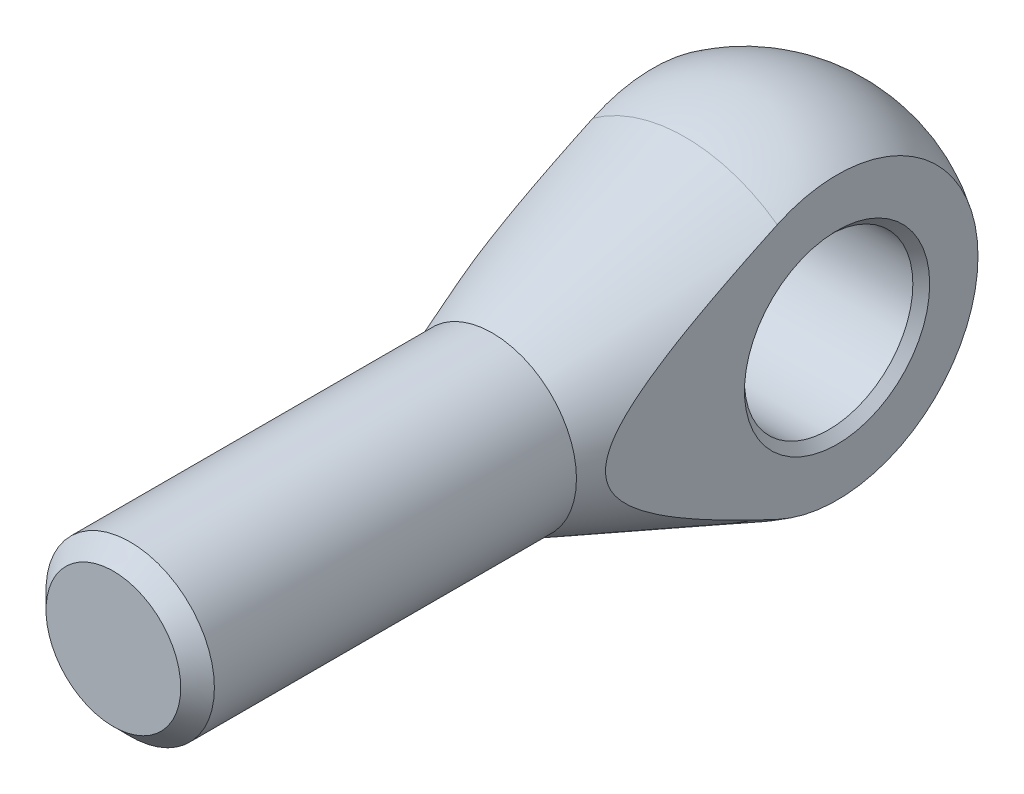
ISO-10303-21;
HEADER;
FILE_DESCRIPTION(('STEP AP214'),'2;1');
FILE_NAME('part.step','',(''),(''),'','','');
FILE_SCHEMA(('AUTOMOTIVE_DESIGN { 1 0 10303 214 1 1 1 1 }'));
ENDSEC;
DATA;
#1=APPLICATION_CONTEXT('core data for automotive mechanical design processes');
#2=APPLICATION_PROTOCOL_DEFINITION('international standard','automotive_design',2000,#1);
#3=PRODUCT_CONTEXT('',#1,'mechanical');
#4=PRODUCT('Part','Part','',(#3));
#5=PRODUCT_RELATED_PRODUCT_CATEGORY('part','',(#4));
#6=PRODUCT_DEFINITION_FORMATION('','',#4);
#7=PRODUCT_DEFINITION_CONTEXT('part definition',#1,'design');
#8=PRODUCT_DEFINITION('design','',#6,#7);
#9=PRODUCT_DEFINITION_SHAPE('','',#8);
#10=(LENGTH_UNIT() NAMED_UNIT(*) SI_UNIT(.MILLI.,.METRE.));
#11=(NAMED_UNIT(*) PLANE_ANGLE_UNIT() SI_UNIT($,.RADIAN.));
#12=(NAMED_UNIT(*) SI_UNIT($,.STERADIAN.) SOLID_ANGLE_UNIT());
#13=UNCERTAINTY_MEASURE_WITH_UNIT(LENGTH_MEASURE(1.E-05),#10,'distance_accuracy_value','');
#14=(GEOMETRIC_REPRESENTATION_CONTEXT(3) GLOBAL_UNCERTAINTY_ASSIGNED_CONTEXT((#13)) GLOBAL_UNIT_ASSIGNED_CONTEXT((#10,
#11,#12)) REPRESENTATION_CONTEXT('',''));
#15=CARTESIAN_POINT('',(0.,0.,0.));
#16=DIRECTION('',(0.,0.,1.));
#17=DIRECTION('',(1.,0.,0.));
#18=AXIS2_PLACEMENT_3D('',#15,#16,#17);
#19=CARTESIAN_POINT('',(0.,0.,0.));
#20=DIRECTION('',(1.,0.,0.));
#21=DIRECTION('',(0.,-1.,0.));
#22=AXIS2_PLACEMENT_3D('',#19,#20,#21);
#23=SPHERICAL_SURFACE('',#22,20.);
#24=CARTESIAN_POINT('',(0.,0.,7.10102051443365));
#25=DIRECTION('',(0.,0.,-1.));
#26=DIRECTION('',(0.,1.,0.));
#27=AXIS2_PLACEMENT_3D('',#24,#25,#26);
#28=CIRCLE('',#27,18.6969384566991);
#29=CARTESIAN_POINT('',(-10.95,-15.1549664352513,7.10102051443364));
#30=VERTEX_POINT('',#29);
#31=CARTESIAN_POINT('',(10.95,-15.1549664352513,7.10102051443365));
#32=VERTEX_POINT('',#31);
#33=EDGE_CURVE('E77',#30,#32,#28,.F.);
#34=ORIENTED_EDGE('',*,*,#33,.F.);
#35=CARTESIAN_POINT('',(-10.95,0.,0.));
#36=DIRECTION('',(-1.,0.,0.));
#37=DIRECTION('',(0.,0.,1.));
#38=AXIS2_PLACEMENT_3D('',#35,#36,#37);
#39=CIRCLE('',#38,16.7361136468417);
#40=CARTESIAN_POINT('',(-10.95,15.1549664352513,7.10102051443365));
#41=VERTEX_POINT('',#40);
#42=EDGE_CURVE('E65',#30,#41,#39,.F.);
#43=ORIENTED_EDGE('',*,*,#42,.T.);
#44=CARTESIAN_POINT('',(10.95,15.1549664352513,7.10102051443365));
#45=VERTEX_POINT('',#44);
#46=EDGE_CURVE('E81',#45,#41,#28,.F.);
#47=ORIENTED_EDGE('',*,*,#46,.F.);
#48=CARTESIAN_POINT('',(10.95,0.,0.));
#49=DIRECTION('',(1.,0.,0.));
#50=DIRECTION('',(0.,0.,-1.));
#51=AXIS2_PLACEMENT_3D('',#48,#49,#50);
#52=CIRCLE('',#51,16.7361136468417);
#53=EDGE_CURVE('E58',#45,#32,#52,.F.);
#54=ORIENTED_EDGE('',*,*,#53,.T.);
#55=EDGE_LOOP('',(#34,#43,#47,#54));
#56=FACE_BOUND('',#55,.T.);
#57=ADVANCED_FACE('F43',(#56),#23,.T.);
#58=CARTESIAN_POINT('',(0.,0.,7.10102051443364));
#59=DIRECTION('',(0.,0.,-1.));
#60=DIRECTION('',(0.,1.,0.));
#61=AXIS2_PLACEMENT_3D('',#58,#59,#60);
#62=CONICAL_SURFACE('',#61,18.6969384566991,0.362968648605641);
#63=CARTESIAN_POINT('',(0.,0.,30.));
#64=DIRECTION('',(0.,0.,1.));
#65=DIRECTION('',(1.,0.,0.));
#66=AXIS2_PLACEMENT_3D('',#63,#64,#65);
#67=CIRCLE('',#66,10.);
#68=CARTESIAN_POINT('',(10.,0.,30.));
#69=VERTEX_POINT('',#68);
#70=EDGE_CURVE('E85',#69,#69,#67,.T.);
#71=ORIENTED_EDGE('',*,*,#70,.F.);
#72=EDGE_LOOP('',(#71));
#73=FACE_BOUND('',#72,.T.);
#74=ORIENTED_EDGE('',*,*,#46,.T.);
#75=CARTESIAN_POINT('',(-10.95,33.6117111502292,-36.7473868844414));
#76=CARTESIAN_POINT('',(-10.95,33.2100087233072,-35.7417349593616));
#77=CARTESIAN_POINT('',(-10.95,32.8077157218095,-34.7363189988211));
#78=CARTESIAN_POINT('',(-10.95,32.0018003338569,-32.7260191972657));
#79=CARTESIAN_POINT('',(-10.95,31.5981779464226,-31.7211353566434));
#80=CARTESIAN_POINT('',(-10.95,30.3850704903985,-28.7073130348301));
#81=CARTESIAN_POINT('',(-10.95,29.5733696972676,-26.6992653148223));
#82=CARTESIAN_POINT('',(-10.95,27.9413836796302,-22.6835120174359));
#83=CARTESIAN_POINT('',(-10.95,27.1210883762279,-20.6758105339449));
#84=CARTESIAN_POINT('',(-10.95,25.4707916822328,-16.664443390457));
#85=CARTESIAN_POINT('',(-10.95,24.6407905016179,-14.6607776442458));
#86=CARTESIAN_POINT('',(-10.95,23.3832101454071,-11.6526201035789));
#87=CARTESIAN_POINT('',(-10.95,22.9604894420974,-10.646097020541));
#88=CARTESIAN_POINT('',(-10.95,22.1111648794169,-8.63469121112854));
#89=CARTESIAN_POINT('',(-10.95,21.6845610261705,-7.62980848216987));
#90=CARTESIAN_POINT('',(-10.95,20.8267363544043,-5.62193345648901));
#91=CARTESIAN_POINT('',(-10.95,20.3955152239481,-4.61894129294296));
#92=CARTESIAN_POINT('',(-10.95,19.5275832192706,-2.61533602472807));
#93=CARTESIAN_POINT('',(-10.95,19.0908723602655,-1.61472291347415));
#94=CARTESIAN_POINT('',(-10.95,18.2110855033613,0.382913644239497));
#95=CARTESIAN_POINT('',(-10.95,17.7680139102391,1.37993902843665));
#96=CARTESIAN_POINT('',(-10.95,16.8736823235612,3.37033269066247));
#97=CARTESIAN_POINT('',(-10.95,16.4224222249312,4.36370092156581));
#98=CARTESIAN_POINT('',(-10.95,15.5096901384702,6.34559948082246));
#99=CARTESIAN_POINT('',(-10.95,15.0482193642475,7.33413036725253));
#100=CARTESIAN_POINT('',(-10.95,14.1121476710677,9.30494471143386));
#101=CARTESIAN_POINT('',(-10.95,13.6375472089903,10.287228385113));
#102=CARTESIAN_POINT('',(-10.95,12.9408840332531,11.6969691534924));
#103=CARTESIAN_POINT('',(-10.95,12.7258235280496,12.1278888460484));
#104=CARTESIAN_POINT('',(-10.95,12.2917992901895,12.9877648924916));
#105=CARTESIAN_POINT('',(-10.95,12.0728355286525,13.4167212318223));
#106=CARTESIAN_POINT('',(-10.95,11.6303521918964,14.2724462389769));
#107=CARTESIAN_POINT('',(-10.95,11.4068312483256,14.6992142001016));
#108=CARTESIAN_POINT('',(-10.95,10.954567840359,15.5499748875007));
#109=CARTESIAN_POINT('',(-10.95,10.7258254132507,15.9739676335654));
#110=CARTESIAN_POINT('',(-10.95,10.2613939787212,16.8200740591547));
#111=CARTESIAN_POINT('',(-10.95,10.0256834257222,17.242175936597));
#112=CARTESIAN_POINT('',(-10.95,9.54692360155703,18.0821937590202));
#113=CARTESIAN_POINT('',(-10.95,9.30387450636588,18.500109804056));
#114=CARTESIAN_POINT('',(-10.95,8.80904725841946,19.3304799028364));
#115=CARTESIAN_POINT('',(-10.95,8.55727351103914,19.7429365718982));
#116=CARTESIAN_POINT('',(-10.95,8.04292231859658,20.5610241312773));
#117=CARTESIAN_POINT('',(-10.95,7.78034590233842,20.9666556664335));
#118=CARTESIAN_POINT('',(-10.95,7.23960258445815,21.7720503819625));
#119=CARTESIAN_POINT('',(-10.95,6.9613306220719,22.1717437135398));
#120=CARTESIAN_POINT('',(-10.95,6.53067505376456,22.7618733866236));
#121=CARTESIAN_POINT('',(-10.95,6.38484825046696,22.9570986234064));
#122=CARTESIAN_POINT('',(-10.95,6.0881771981951,23.3436910460863));
#123=CARTESIAN_POINT('',(-10.95,5.93733329791744,23.5350584986272));
#124=CARTESIAN_POINT('',(-10.95,5.63077086236499,23.9120415169794));
#125=CARTESIAN_POINT('',(-10.95,5.47508526660816,24.0976837876929));
#126=CARTESIAN_POINT('',(-10.95,5.15717583081845,24.4632614250757));
#127=CARTESIAN_POINT('',(-10.95,4.99495295364302,24.6431976252502));
#128=CARTESIAN_POINT('',(-10.95,4.66313643223939,24.995728664026));
#129=CARTESIAN_POINT('',(-10.95,4.49355270824336,25.1683327988046));
#130=CARTESIAN_POINT('',(-10.95,4.14566626307245,25.5044679715233));
#131=CARTESIAN_POINT('',(-10.95,3.96736698861797,25.6680025424362));
#132=CARTESIAN_POINT('',(-10.95,3.66128628131259,25.9312199338345));
#133=CARTESIAN_POINT('',(-10.95,3.53629016963108,26.0341390287964));
#134=CARTESIAN_POINT('',(-10.95,3.28133090419108,26.2336790845882));
#135=CARTESIAN_POINT('',(-10.95,3.15136739943034,26.3302995990424));
#136=CARTESIAN_POINT('',(-10.95,2.88602358056451,26.5159738348143));
#137=CARTESIAN_POINT('',(-10.95,2.75064135477668,26.6050248504388));
#138=CARTESIAN_POINT('',(-10.95,2.47429160016425,26.773892011185));
#139=CARTESIAN_POINT('',(-10.95,2.3333248298523,26.8537094047162));
#140=CARTESIAN_POINT('',(-10.95,1.94398775658874,27.0546611626469));
#141=CARTESIAN_POINT('',(-10.95,1.68989652496238,27.1653037907263));
#142=CARTESIAN_POINT('',(-10.95,1.29803225675867,27.298798828343));
#143=CARTESIAN_POINT('',(-10.95,1.16568400184323,27.3378755468031));
#144=CARTESIAN_POINT('',(-10.95,0.898038721377125,27.4039807051444));
#145=CARTESIAN_POINT('',(-10.95,0.762743441456939,27.4310160843652));
#146=CARTESIAN_POINT('',(-10.95,0.488705913790869,27.472227697509));
#147=CARTESIAN_POINT('',(-10.95,0.349942255463335,27.4862628016695));
#148=CARTESIAN_POINT('',(-10.95,0.0717033778222913,27.500363811325));
#149=CARTESIAN_POINT('',(-10.95,-0.067771812589703,27.5004302797607));
#150=CARTESIAN_POINT('',(-10.95,-0.346120162657845,27.4865857143661));
#151=CARTESIAN_POINT('',(-10.95,-0.484992816520058,27.4726646162149));
#152=CARTESIAN_POINT('',(-10.95,-0.760727242900616,27.4314376993854));
#153=CARTESIAN_POINT('',(-10.95,-0.897588769927313,27.4041302604318));
#154=CARTESIAN_POINT('',(-10.95,-1.18085762309287,27.3340854850686));
#155=CARTESIAN_POINT('',(-10.95,-1.32696674399089,27.2901478893058));
#156=CARTESIAN_POINT('',(-10.95,-1.61468037543159,27.189306774172));
#157=CARTESIAN_POINT('',(-10.95,-1.75628164999085,27.1323941695975));
#158=CARTESIAN_POINT('',(-10.95,-2.17377369890063,26.9449108319188));
#159=CARTESIAN_POINT('',(-10.95,-2.44220606848874,26.7976341442337));
#160=CARTESIAN_POINT('',(-10.95,-2.93407515179228,26.4875701703933));
#161=CARTESIAN_POINT('',(-10.95,-3.15936141832807,26.3276028915265));
#162=CARTESIAN_POINT('',(-10.95,-3.5956500495048,25.9890096488688));
#163=CARTESIAN_POINT('',(-10.95,-3.80663902512319,25.8103665830865));
#164=CARTESIAN_POINT('',(-10.95,-4.21688715470744,25.4388061611562));
#165=CARTESIAN_POINT('',(-10.95,-4.4161015100315,25.2458398927565));
#166=CARTESIAN_POINT('',(-10.95,-4.70690853217967,24.9487233221588));
#167=CARTESIAN_POINT('',(-10.95,-4.80249054619742,24.8484269661759));
#168=CARTESIAN_POINT('',(-10.95,-4.99121797099734,24.6455666765238));
#169=CARTESIAN_POINT('',(-10.95,-5.08436339516438,24.5430027553168));
#170=CARTESIAN_POINT('',(-10.95,-5.3538739763897,24.2397302010473));
#171=CARTESIAN_POINT('',(-10.95,-5.52720294589203,24.036319825678));
#172=CARTESIAN_POINT('',(-10.95,-5.8667773286528,23.6236508754011));
#173=CARTESIAN_POINT('',(-10.95,-6.03302156085291,23.4143913349642));
#174=CARTESIAN_POINT('',(-10.95,-6.35949535205869,22.9910513173421));
#175=CARTESIAN_POINT('',(-10.95,-6.51972139630262,22.7769681363007));
#176=CARTESIAN_POINT('',(-10.95,-6.83488007897038,22.3449329120949));
#177=CARTESIAN_POINT('',(-10.95,-6.9898123755094,22.1269806204286));
#178=CARTESIAN_POINT('',(-10.95,-7.4483760399936,21.4673808373101));
#179=CARTESIAN_POINT('',(-10.95,-7.74507506060751,21.0209112441707));
#180=CARTESIAN_POINT('',(-10.95,-8.32420109044812,20.1188100878175));
#181=CARTESIAN_POINT('',(-10.95,-8.6066262643993,19.6631773569182));
#182=CARTESIAN_POINT('',(-10.95,-9.02300492631213,18.9724610232141));
#183=CARTESIAN_POINT('',(-10.95,-9.16120701213975,18.7399237596161));
#184=CARTESIAN_POINT('',(-10.95,-9.43498757849718,18.2733332431444));
#185=CARTESIAN_POINT('',(-10.95,-9.57056625472792,18.0392801051039));
#186=CARTESIAN_POINT('',(-10.95,-9.97380851664279,17.3350620874898));
#187=CARTESIAN_POINT('',(-10.95,-10.2379531332269,16.8628806460893));
#188=CARTESIAN_POINT('',(-10.95,-10.7581044356187,15.9150581516268));
#189=CARTESIAN_POINT('',(-10.95,-11.0141234957464,15.4394238630781));
#190=CARTESIAN_POINT('',(-10.95,-11.5197188561085,14.4847699564357));
#191=CARTESIAN_POINT('',(-10.95,-11.7692953836263,14.0057504585288));
#192=CARTESIAN_POINT('',(-10.95,-12.2870580221873,12.9981112885397));
#193=CARTESIAN_POINT('',(-10.95,-12.5546880734431,12.4692063019444));
#194=CARTESIAN_POINT('',(-10.95,-13.0844262053536,11.4086347917532));
#195=CARTESIAN_POINT('',(-10.95,-13.3465342202796,10.8769682353802));
#196=CARTESIAN_POINT('',(-10.95,-13.8660531072914,9.81131283657434));
#197=CARTESIAN_POINT('',(-10.95,-14.1234637304854,9.2773238729342));
#198=CARTESIAN_POINT('',(-10.95,-14.6342247858855,8.20740630777338));
#199=CARTESIAN_POINT('',(-10.95,-14.8875751947647,7.67147769513063));
#200=CARTESIAN_POINT('',(-10.95,-15.642461174617,6.06100943113125));
#201=CARTESIAN_POINT('',(-10.95,-16.1387285643732,4.98399968103441));
#202=CARTESIAN_POINT('',(-10.95,-17.1204631578094,2.82506938339125));
#203=CARTESIAN_POINT('',(-10.95,-17.605930232712,1.7431487774754));
#204=CARTESIAN_POINT('',(-10.95,-18.3280816448888,0.116570996183408));
#205=CARTESIAN_POINT('',(-10.95,-18.5679759046434,-0.426664227899682));
#206=CARTESIAN_POINT('',(-10.95,-19.0458304945214,-1.51397986348042));
#207=CARTESIAN_POINT('',(-10.95,-19.2837908388247,-2.05806026874614));
#208=CARTESIAN_POINT('',(-10.95,-19.9950782157829,-3.69144165744211));
#209=CARTESIAN_POINT('',(-10.95,-20.4658077364439,-4.78187411052378));
#210=CARTESIAN_POINT('',(-10.95,-21.4015389530705,-6.96502236343922));
#211=CARTESIAN_POINT('',(-10.95,-21.8665413870241,-8.05773784740234));
#212=CARTESIAN_POINT('',(-10.95,-22.791830118973,-10.2451640600059));
#213=CARTESIAN_POINT('',(-10.95,-23.2521164108862,-11.3398747912174));
#214=CARTESIAN_POINT('',(-10.95,-24.5557492331203,-14.4560329541505));
#215=CARTESIAN_POINT('',(-10.95,-25.3943569244173,-16.4794626912536));
#216=CARTESIAN_POINT('',(-10.95,-27.0616145709659,-20.5305051617139));
#217=CARTESIAN_POINT('',(-10.95,-27.8902641341802,-22.558118056098));
#218=CARTESIAN_POINT('',(-10.95,-29.5377964173734,-26.6113591628902));
#219=CARTESIAN_POINT('',(-10.95,-30.3566984745872,-28.6369795196071));
#220=CARTESIAN_POINT('',(-10.95,-31.5805135935852,-31.6771769022293));
#221=CARTESIAN_POINT('',(-10.95,-31.9876857319123,-32.6908456810704));
#222=CARTESIAN_POINT('',(-10.95,-32.8006759147025,-34.7187252449435));
#223=CARTESIAN_POINT('',(-10.95,-33.2064939601989,-35.7329360295612));
#224=CARTESIAN_POINT('',(-10.95,-33.6117111502292,-36.7473868844414));
#225=B_SPLINE_CURVE_WITH_KNOTS('',3,(#75,#76,#77,#78,#79,#80,#81,#82,#83,#84,#85,#86,#87,#88,
#89,#90,#91,#92,#93,#94,#95,#96,#97,#98,#99,#100,#101,#102,#103,#104,#105,#106,#107,#108,#109,
#110,#111,#112,#113,#114,#115,#116,#117,#118,#119,#120,#121,#122,#123,#124,#125,#126,#127,#128,
#129,#130,#131,#132,#133,#134,#135,#136,#137,#138,#139,#140,#141,#142,#143,#144,#145,#146,#147,
#148,#149,#150,#151,#152,#153,#154,#155,#156,#157,#158,#159,#160,#161,#162,#163,#164,#165,#166,
#167,#168,#169,#170,#171,#172,#173,#174,#175,#176,#177,#178,#179,#180,#181,#182,#183,#184,#185,
#186,#187,#188,#189,#190,#191,#192,#193,#194,#195,#196,#197,#198,#199,#200,#201,#202,#203,#204,
#205,#206,#207,#208,#209,#210,#211,#212,#213,#214,#215,#216,#217,#218,#219,#220,#221,#222,#223,
#224),.UNSPECIFIED.,.F.,.F.,(4,2,2,2,2,2,2,2,2,2,2,2,2,2,2,2,2,2,2,2,2,2,2,2,2,2,2,2,2,2,2,2,2,
2,2,2,2,2,2,2,2,2,2,2,2,2,2,2,2,2,2,2,2,2,2,2,2,2,2,2,2,2,2,2,2,2,2,2,2,2,2,2,2,2,4),(0.,
3.24873867555938,6.4974797451895,12.9951607323639,19.5015823416852,26.007863449845,
29.2829194521491,32.5579702901449,35.8332437995588,39.1085082326272,42.3816045967868,
45.6547429908025,48.9274944178938,52.2001321044556,53.64492976606,55.0897381222216,
56.5349868828041,57.9802253258489,59.4305314720913,60.8808028681897,62.3303523480678,
63.7797640966289,65.2404094780302,65.9713749950522,66.7022898144808,67.429010381264,
68.1556242998897,68.881287646476,69.6066663022981,70.092244917844,70.5778579086499,
71.0636437566711,71.5493638482422,72.3771682641807,72.7907038270207,73.2040007628756,
73.6217335579651,74.039449518283,74.4574662485828,74.8755335878936,75.3325402189688,
75.7898678379036,76.7049729710382,77.5327790155381,78.3613498600875,79.1928933555429,
79.6085025887215,80.0241095383608,80.825625591773,81.6272747430609,82.4293850183088,
83.2315469985102,84.8393362776209,86.4473317568204,87.258834487682,88.0702764468997,
89.6933073866293,91.3137348345806,92.9341050377958,94.7123511557926,96.4906184282429,
98.2689796503822,100.047351085964,103.6048017838,107.162294876148,108.94383140567,
110.725354860831,114.288430328239,117.851041752989,121.4136577717,127.984596899439,
134.55579387387,141.110446653136,144.387612680272,147.664776205967),.UNSPECIFIED.);
#226=EDGE_CURVE('E76',#41,#30,#225,.T.);
#227=ORIENTED_EDGE('',*,*,#226,.T.);
#228=ORIENTED_EDGE('',*,*,#33,.T.);
#229=CARTESIAN_POINT('',(10.95,-33.6117111502292,-36.7473868844414));
#230=CARTESIAN_POINT('',(10.95,-33.2100087233071,-35.7417349593616));
#231=CARTESIAN_POINT('',(10.95,-32.8077157218094,-34.7363189988211));
#232=CARTESIAN_POINT('',(10.95,-32.0018003338569,-32.7260191972657));
#233=CARTESIAN_POINT('',(10.95,-31.5981779464226,-31.7211353566434));
#234=CARTESIAN_POINT('',(10.95,-30.3850704903985,-28.7073130348301));
#235=CARTESIAN_POINT('',(10.95,-29.5733696972676,-26.6992653148223));
#236=CARTESIAN_POINT('',(10.95,-27.9413836796302,-22.6835120174359));
#237=CARTESIAN_POINT('',(10.95,-27.1210883762279,-20.6758105339449));
#238=CARTESIAN_POINT('',(10.95,-25.4707916822328,-16.664443390457));
#239=CARTESIAN_POINT('',(10.95,-24.6407905016178,-14.6607776442458));
#240=CARTESIAN_POINT('',(10.95,-23.3832101454071,-11.6526201035789));
#241=CARTESIAN_POINT('',(10.95,-22.9604894420974,-10.646097020541));
#242=CARTESIAN_POINT('',(10.95,-22.1111648794169,-8.63469121112854));
#243=CARTESIAN_POINT('',(10.95,-21.6845610261705,-7.62980848216987));
#244=CARTESIAN_POINT('',(10.95,-20.8267363544043,-5.62193345648901));
#245=CARTESIAN_POINT('',(10.95,-20.3955152239481,-4.61894129294297));
#246=CARTESIAN_POINT('',(10.95,-19.5275832192706,-2.61533602472807));
#247=CARTESIAN_POINT('',(10.95,-19.0908723602655,-1.61472291347415));
#248=CARTESIAN_POINT('',(10.95,-18.2110855033613,0.382913644239501));
#249=CARTESIAN_POINT('',(10.95,-17.7680139102391,1.37993902843666));
#250=CARTESIAN_POINT('',(10.95,-16.8736823235612,3.37033269066248));
#251=CARTESIAN_POINT('',(10.95,-16.4224222249312,4.36370092156582));
#252=CARTESIAN_POINT('',(10.95,-15.5096901384702,6.34559948082246));
#253=CARTESIAN_POINT('',(10.95,-15.0482193642475,7.33413036725254));
#254=CARTESIAN_POINT('',(10.95,-14.1121476710677,9.30494471143387));
#255=CARTESIAN_POINT('',(10.95,-13.6375472089903,10.287228385113));
#256=CARTESIAN_POINT('',(10.95,-12.9408840332531,11.6969691534924));
#257=CARTESIAN_POINT('',(10.95,-12.7258235280496,12.1278888460484));
#258=CARTESIAN_POINT('',(10.95,-12.2917992901895,12.9877648924916));
#259=CARTESIAN_POINT('',(10.95,-12.0728355286525,13.4167212318223));
#260=CARTESIAN_POINT('',(10.95,-11.6303521918964,14.2724462389769));
#261=CARTESIAN_POINT('',(10.95,-11.4068312483256,14.6992142001016));
#262=CARTESIAN_POINT('',(10.95,-10.954567840359,15.5499748875007));
#263=CARTESIAN_POINT('',(10.95,-10.7258254132507,15.9739676335654));
#264=CARTESIAN_POINT('',(10.95,-10.2613939787212,16.8200740591547));
#265=CARTESIAN_POINT('',(10.95,-10.0256834257222,17.242175936597));
#266=CARTESIAN_POINT('',(10.95,-9.54692360155703,18.0821937590202));
#267=CARTESIAN_POINT('',(10.95,-9.30387450636588,18.500109804056));
#268=CARTESIAN_POINT('',(10.95,-8.80904725841946,19.3304799028364));
#269=CARTESIAN_POINT('',(10.95,-8.55727351103915,19.7429365718982));
#270=CARTESIAN_POINT('',(10.95,-8.04292231859659,20.5610241312773));
#271=CARTESIAN_POINT('',(10.95,-7.78034590233842,20.9666556664335));
#272=CARTESIAN_POINT('',(10.95,-7.23960258445815,21.7720503819625));
#273=CARTESIAN_POINT('',(10.95,-6.9613306220719,22.1717437135398));
#274=CARTESIAN_POINT('',(10.95,-6.53067505376456,22.7618733866236));
#275=CARTESIAN_POINT('',(10.95,-6.38484825046695,22.9570986234064));
#276=CARTESIAN_POINT('',(10.95,-6.08817719819509,23.3436910460863));
#277=CARTESIAN_POINT('',(10.95,-5.93733329791743,23.5350584986273));
#278=CARTESIAN_POINT('',(10.95,-5.63077086236499,23.9120415169794));
#279=CARTESIAN_POINT('',(10.95,-5.47508526660817,24.0976837876929));
#280=CARTESIAN_POINT('',(10.95,-5.15717583081845,24.4632614250757));
#281=CARTESIAN_POINT('',(10.95,-4.99495295364303,24.6431976252502));
#282=CARTESIAN_POINT('',(10.95,-4.6631364322394,24.995728664026));
#283=CARTESIAN_POINT('',(10.95,-4.49355270824336,25.1683327988046));
#284=CARTESIAN_POINT('',(10.95,-4.14566626307245,25.5044679715233));
#285=CARTESIAN_POINT('',(10.95,-3.96736698861797,25.6680025424362));
#286=CARTESIAN_POINT('',(10.95,-3.66128628131259,25.9312199338345));
#287=CARTESIAN_POINT('',(10.95,-3.53629016963108,26.0341390287964));
#288=CARTESIAN_POINT('',(10.95,-3.28133090419108,26.2336790845882));
#289=CARTESIAN_POINT('',(10.95,-3.15136739943035,26.3302995990424));
#290=CARTESIAN_POINT('',(10.95,-2.88602358056451,26.5159738348143));
#291=CARTESIAN_POINT('',(10.95,-2.75064135477669,26.6050248504388));
#292=CARTESIAN_POINT('',(10.95,-2.47429160016425,26.773892011185));
#293=CARTESIAN_POINT('',(10.95,-2.33332482985231,26.8537094047162));
#294=CARTESIAN_POINT('',(10.95,-1.94398775658875,27.0546611626469));
#295=CARTESIAN_POINT('',(10.95,-1.6898965249624,27.1653037907263));
#296=CARTESIAN_POINT('',(10.95,-1.29803225675869,27.298798828343));
#297=CARTESIAN_POINT('',(10.95,-1.16568400184324,27.3378755468031));
#298=CARTESIAN_POINT('',(10.95,-0.898038721377133,27.4039807051444));
#299=CARTESIAN_POINT('',(10.95,-0.762743441456947,27.4310160843652));
#300=CARTESIAN_POINT('',(10.95,-0.488705913790873,27.472227697509));
#301=CARTESIAN_POINT('',(10.95,-0.349942255463334,27.4862628016695));
#302=CARTESIAN_POINT('',(10.95,-0.0717033778222897,27.500363811325));
#303=CARTESIAN_POINT('',(10.95,0.0677718125897002,27.5004302797607));
#304=CARTESIAN_POINT('',(10.95,0.346120162657838,27.4865857143661));
#305=CARTESIAN_POINT('',(10.95,0.484992816520051,27.4726646162149));
#306=CARTESIAN_POINT('',(10.95,0.760727242900609,27.4314376993853));
#307=CARTESIAN_POINT('',(10.95,0.897588769927306,27.4041302604318));
#308=CARTESIAN_POINT('',(10.95,1.18085762309287,27.3340854850686));
#309=CARTESIAN_POINT('',(10.95,1.32696674399089,27.2901478893058));
#310=CARTESIAN_POINT('',(10.95,1.61468037543159,27.189306774172));
#311=CARTESIAN_POINT('',(10.95,1.75628164999086,27.1323941695975));
#312=CARTESIAN_POINT('',(10.95,2.17377369890063,26.9449108319188));
#313=CARTESIAN_POINT('',(10.95,2.44220606848874,26.7976341442337));
#314=CARTESIAN_POINT('',(10.95,2.93407515179227,26.4875701703933));
#315=CARTESIAN_POINT('',(10.95,3.15936141832807,26.3276028915265));
#316=CARTESIAN_POINT('',(10.95,3.59565004950481,25.9890096488688));
#317=CARTESIAN_POINT('',(10.95,3.80663902512319,25.8103665830865));
#318=CARTESIAN_POINT('',(10.95,4.21688715470743,25.4388061611562));
#319=CARTESIAN_POINT('',(10.95,4.4161015100315,25.2458398927565));
#320=CARTESIAN_POINT('',(10.95,4.70690853217968,24.9487233221588));
#321=CARTESIAN_POINT('',(10.95,4.80249054619743,24.8484269661759));
#322=CARTESIAN_POINT('',(10.95,4.99121797099734,24.6455666765238));
#323=CARTESIAN_POINT('',(10.95,5.08436339516437,24.5430027553168));
#324=CARTESIAN_POINT('',(10.95,5.35387397638969,24.2397302010473));
#325=CARTESIAN_POINT('',(10.95,5.52720294589203,24.036319825678));
#326=CARTESIAN_POINT('',(10.95,5.86677732865279,23.6236508754011));
#327=CARTESIAN_POINT('',(10.95,6.03302156085291,23.4143913349642));
#328=CARTESIAN_POINT('',(10.95,6.35949535205868,22.9910513173421));
#329=CARTESIAN_POINT('',(10.95,6.5197213963026,22.7769681363007));
#330=CARTESIAN_POINT('',(10.95,6.83488007897037,22.3449329120949));
#331=CARTESIAN_POINT('',(10.95,6.98981237550939,22.1269806204286));
#332=CARTESIAN_POINT('',(10.95,7.44837603999359,21.4673808373102));
#333=CARTESIAN_POINT('',(10.95,7.7450750606075,21.0209112441708));
#334=CARTESIAN_POINT('',(10.95,8.32420109044811,20.1188100878175));
#335=CARTESIAN_POINT('',(10.95,8.60662626439929,19.6631773569182));
#336=CARTESIAN_POINT('',(10.95,9.02300492631212,18.9724610232141));
#337=CARTESIAN_POINT('',(10.95,9.16120701213975,18.7399237596161));
#338=CARTESIAN_POINT('',(10.95,9.43498757849718,18.2733332431444));
#339=CARTESIAN_POINT('',(10.95,9.57056625472792,18.0392801051039));
#340=CARTESIAN_POINT('',(10.95,9.97380851664278,17.3350620874898));
#341=CARTESIAN_POINT('',(10.95,10.2379531332269,16.8628806460893));
#342=CARTESIAN_POINT('',(10.95,10.7581044356187,15.9150581516268));
#343=CARTESIAN_POINT('',(10.95,11.0141234957464,15.4394238630781));
#344=CARTESIAN_POINT('',(10.95,11.5197188561085,14.4847699564357));
#345=CARTESIAN_POINT('',(10.95,11.7692953836263,14.0057504585288));
#346=CARTESIAN_POINT('',(10.95,12.2870580221873,12.9981112885397));
#347=CARTESIAN_POINT('',(10.95,12.5546880734431,12.4692063019444));
#348=CARTESIAN_POINT('',(10.95,13.0844262053536,11.4086347917532));
#349=CARTESIAN_POINT('',(10.95,13.3465342202796,10.8769682353802));
#350=CARTESIAN_POINT('',(10.95,13.8660531072914,9.81131283657434));
#351=CARTESIAN_POINT('',(10.95,14.1234637304854,9.2773238729342));
#352=CARTESIAN_POINT('',(10.95,14.6342247858855,8.20740630777339));
#353=CARTESIAN_POINT('',(10.95,14.8875751947647,7.67147769513064));
#354=CARTESIAN_POINT('',(10.95,15.642461174617,6.06100943113126));
#355=CARTESIAN_POINT('',(10.95,16.1387285643732,4.98399968103443));
#356=CARTESIAN_POINT('',(10.95,17.1204631578094,2.82506938339127));
#357=CARTESIAN_POINT('',(10.95,17.605930232712,1.74314877747541));
#358=CARTESIAN_POINT('',(10.95,18.3280816448888,0.116570996183423));
#359=CARTESIAN_POINT('',(10.95,18.5679759046434,-0.426664227899662));
#360=CARTESIAN_POINT('',(10.95,19.0458304945214,-1.5139798634804));
#361=CARTESIAN_POINT('',(10.95,19.2837908388247,-2.05806026874612));
#362=CARTESIAN_POINT('',(10.95,19.9950782157829,-3.6914416574421));
#363=CARTESIAN_POINT('',(10.95,20.4658077364439,-4.78187411052376));
#364=CARTESIAN_POINT('',(10.95,21.4015389530705,-6.96502236343919));
#365=CARTESIAN_POINT('',(10.95,21.8665413870241,-8.05773784740231));
#366=CARTESIAN_POINT('',(10.95,22.791830118973,-10.2451640600059));
#367=CARTESIAN_POINT('',(10.95,23.2521164108862,-11.3398747912174));
#368=CARTESIAN_POINT('',(10.95,24.5557492331203,-14.4560329541505));
#369=CARTESIAN_POINT('',(10.95,25.3943569244173,-16.4794626912536));
#370=CARTESIAN_POINT('',(10.95,27.0616145709659,-20.5305051617139));
#371=CARTESIAN_POINT('',(10.95,27.8902641341802,-22.558118056098));
#372=CARTESIAN_POINT('',(10.95,29.5377964173734,-26.6113591628902));
#373=CARTESIAN_POINT('',(10.95,30.3566984745872,-28.6369795196071));
#374=CARTESIAN_POINT('',(10.95,31.5805135935852,-31.6771769022293));
#375=CARTESIAN_POINT('',(10.95,31.9876857319123,-32.6908456810704));
#376=CARTESIAN_POINT('',(10.95,32.8006759147025,-34.7187252449435));
#377=CARTESIAN_POINT('',(10.95,33.2064939601989,-35.7329360295612));
#378=CARTESIAN_POINT('',(10.95,33.6117111502292,-36.7473868844414));
#379=B_SPLINE_CURVE_WITH_KNOTS('',3,(#229,#230,#231,#232,#233,#234,#235,#236,#237,#238,#239,
#240,#241,#242,#243,#244,#245,#246,#247,#248,#249,#250,#251,#252,#253,#254,#255,#256,#257,#258,
#259,#260,#261,#262,#263,#264,#265,#266,#267,#268,#269,#270,#271,#272,#273,#274,#275,#276,#277,
#278,#279,#280,#281,#282,#283,#284,#285,#286,#287,#288,#289,#290,#291,#292,#293,#294,#295,#296,
#297,#298,#299,#300,#301,#302,#303,#304,#305,#306,#307,#308,#309,#310,#311,#312,#313,#314,#315,
#316,#317,#318,#319,#320,#321,#322,#323,#324,#325,#326,#327,#328,#329,#330,#331,#332,#333,#334,
#335,#336,#337,#338,#339,#340,#341,#342,#343,#344,#345,#346,#347,#348,#349,#350,#351,#352,#353,
#354,#355,#356,#357,#358,#359,#360,#361,#362,#363,#364,#365,#366,#367,#368,#369,#370,#371,#372,
#373,#374,#375,#376,#377,#378),.UNSPECIFIED.,.F.,.F.,(4,2,2,2,2,2,2,2,2,2,2,2,2,2,2,2,2,2,2,2,2,
2,2,2,2,2,2,2,2,2,2,2,2,2,2,2,2,2,2,2,2,2,2,2,2,2,2,2,2,2,2,2,2,2,2,2,2,2,2,2,2,2,2,2,2,2,2,2,2,
2,2,2,2,2,4),(0.,3.24873867555937,6.4974797451895,12.9951607323639,19.5015823416852,
26.007863449845,29.2829194521491,32.5579702901449,35.8332437995588,39.1085082326272,
42.3816045967868,45.6547429908025,48.9274944178938,52.2001321044556,53.64492976606,
55.0897381222216,56.5349868828041,57.9802253258489,59.4305314720912,60.8808028681897,
62.3303523480678,63.7797640966289,65.2404094780302,65.9713749950522,66.7022898144808,
67.429010381264,68.1556242998897,68.881287646476,69.6066663022981,70.092244917844,
70.5778579086499,71.0636437566711,71.5493638482422,72.3771682641806,72.7907038270207,
73.2040007628756,73.6217335579651,74.039449518283,74.4574662485828,74.8755335878935,
75.3325402189688,75.7898678379036,76.7049729710382,77.5327790155381,78.3613498600875,
79.1928933555429,79.6085025887214,80.0241095383608,80.825625591773,81.6272747430608,
82.4293850183087,83.2315469985102,84.8393362776209,86.4473317568204,87.258834487682,
88.0702764468997,89.6933073866293,91.3137348345805,92.9341050377958,94.7123511557926,
96.4906184282428,98.2689796503822,100.047351085964,103.6048017838,107.162294876148,
108.94383140567,110.725354860831,114.288430328239,117.851041752989,121.4136577717,
127.984596899439,134.55579387387,141.110446653136,144.387612680272,147.664776205967),.UNSPECIFIED.);
#380=EDGE_CURVE('E70',#32,#45,#379,.T.);
#381=ORIENTED_EDGE('',*,*,#380,.T.);
#382=EDGE_LOOP('',(#74,#227,#228,#381));
#383=FACE_BOUND('',#382,.T.);
#384=ADVANCED_FACE('F83',(#73,#383),#62,.T.);
#385=CARTESIAN_POINT('',(0.,0.,30.));
#386=DIRECTION('',(0.,0.,1.));
#387=DIRECTION('',(1.,0.,0.));
#388=AXIS2_PLACEMENT_3D('',#385,#386,#387);
#389=CYLINDRICAL_SURFACE('',#388,10.);
#390=CARTESIAN_POINT('',(0.,0.,73.));
#391=DIRECTION('',(0.,0.,1.));
#392=DIRECTION('',(1.,0.,0.));
#393=AXIS2_PLACEMENT_3D('',#390,#391,#392);
#394=CIRCLE('',#393,10.);
#395=CARTESIAN_POINT('',(10.,0.,73.));
#396=VERTEX_POINT('',#395);
#397=EDGE_CURVE('E12',#396,#396,#394,.F.);
#398=CARTESIAN_POINT('',(10.,0.,73.));
#399=CARTESIAN_POINT('',(10.,0.,72.5520833333334));
#400=CARTESIAN_POINT('',(10.,0.,72.1041666666667));
#401=CARTESIAN_POINT('',(10.,0.,71.2083333333334));
#402=CARTESIAN_POINT('',(10.,0.,70.7604166666667));
#403=CARTESIAN_POINT('',(10.,0.,69.8645833333334));
#404=CARTESIAN_POINT('',(10.,0.,69.4166666666667));
#405=CARTESIAN_POINT('',(10.,0.,68.5208333333334));
#406=CARTESIAN_POINT('',(10.,0.,68.0729166666667));
#407=CARTESIAN_POINT('',(10.,0.,67.1770833333333));
#408=CARTESIAN_POINT('',(10.,0.,66.7291666666667));
#409=CARTESIAN_POINT('',(10.,0.,65.8333333333334));
#410=CARTESIAN_POINT('',(10.,0.,65.3854166666667));
#411=CARTESIAN_POINT('',(10.,0.,64.4895833333334));
#412=CARTESIAN_POINT('',(10.,0.,64.0416666666667));
#413=CARTESIAN_POINT('',(10.,0.,63.1458333333334));
#414=CARTESIAN_POINT('',(10.,0.,62.6979166666667));
#415=CARTESIAN_POINT('',(10.,0.,61.8020833333334));
#416=CARTESIAN_POINT('',(10.,0.,61.3541666666667));
#417=CARTESIAN_POINT('',(10.,0.,60.4583333333334));
#418=CARTESIAN_POINT('',(10.,0.,60.0104166666667));
#419=CARTESIAN_POINT('',(10.,0.,59.1145833333333));
#420=CARTESIAN_POINT('',(10.,0.,58.6666666666667));
#421=CARTESIAN_POINT('',(10.,0.,57.7708333333334));
#422=CARTESIAN_POINT('',(10.,0.,57.3229166666667));
#423=CARTESIAN_POINT('',(10.,0.,56.4270833333334));
#424=CARTESIAN_POINT('',(10.,0.,55.9791666666667));
#425=CARTESIAN_POINT('',(10.,0.,55.0833333333333));
#426=CARTESIAN_POINT('',(10.,0.,54.6354166666667));
#427=CARTESIAN_POINT('',(10.,0.,53.7395833333333));
#428=CARTESIAN_POINT('',(10.,0.,53.2916666666667));
#429=CARTESIAN_POINT('',(10.,0.,52.3958333333333));
#430=CARTESIAN_POINT('',(10.,0.,51.9479166666667));
#431=CARTESIAN_POINT('',(10.,0.,51.0520833333333));
#432=CARTESIAN_POINT('',(10.,0.,50.6041666666667));
#433=CARTESIAN_POINT('',(10.,0.,49.7083333333333));
#434=CARTESIAN_POINT('',(10.,0.,49.2604166666667));
#435=CARTESIAN_POINT('',(10.,0.,48.3645833333333));
#436=CARTESIAN_POINT('',(10.,0.,47.9166666666667));
#437=CARTESIAN_POINT('',(10.,0.,47.0208333333333));
#438=CARTESIAN_POINT('',(10.,0.,46.5729166666667));
#439=CARTESIAN_POINT('',(10.,0.,45.6770833333333));
#440=CARTESIAN_POINT('',(10.,0.,45.2291666666667));
#441=CARTESIAN_POINT('',(10.,0.,44.3333333333333));
#442=CARTESIAN_POINT('',(10.,0.,43.8854166666667));
#443=CARTESIAN_POINT('',(10.,0.,42.9895833333333));
#444=CARTESIAN_POINT('',(10.,0.,42.5416666666667));
#445=CARTESIAN_POINT('',(10.,0.,41.6458333333333));
#446=CARTESIAN_POINT('',(10.,0.,41.1979166666667));
#447=CARTESIAN_POINT('',(10.,0.,40.3020833333333));
#448=CARTESIAN_POINT('',(10.,0.,39.8541666666667));
#449=CARTESIAN_POINT('',(10.,0.,38.9583333333333));
#450=CARTESIAN_POINT('',(10.,0.,38.5104166666667));
#451=CARTESIAN_POINT('',(10.,0.,37.6145833333333));
#452=CARTESIAN_POINT('',(10.,0.,37.1666666666667));
#453=CARTESIAN_POINT('',(10.,0.,36.2708333333333));
#454=CARTESIAN_POINT('',(10.,0.,35.8229166666667));
#455=CARTESIAN_POINT('',(10.,0.,34.9270833333333));
#456=CARTESIAN_POINT('',(10.,0.,34.4791666666667));
#457=CARTESIAN_POINT('',(10.,0.,33.5833333333333));
#458=CARTESIAN_POINT('',(10.,0.,33.1354166666667));
#459=CARTESIAN_POINT('',(10.,0.,32.2395833333333));
#460=CARTESIAN_POINT('',(10.,0.,31.7916666666667));
#461=CARTESIAN_POINT('',(10.,0.,30.8958333333333));
#462=CARTESIAN_POINT('',(10.,0.,30.4479166666667));
#463=CARTESIAN_POINT('',(10.,0.,30.));
#464=B_SPLINE_CURVE_WITH_KNOTS('',3,(#398,#399,#400,#401,#402,#403,#404,#405,#406,#407,#408,
#409,#410,#411,#412,#413,#414,#415,#416,#417,#418,#419,#420,#421,#422,#423,#424,#425,#426,#427,
#428,#429,#430,#431,#432,#433,#434,#435,#436,#437,#438,#439,#440,#441,#442,#443,#444,#445,#446,
#447,#448,#449,#450,#451,#452,#453,#454,#455,#456,#457,#458,#459,#460,#461,#462,#463),
.UNSPECIFIED.,.F.,.F.,(4,2,2,2,2,2,2,2,2,2,2,2,2,2,2,2,2,2,2,2,2,2,2,2,2,2,2,2,2,2,2,2,4),(0.,
1.34375,2.68750000000001,4.03125000000001,5.37500000000002,6.71875000000002,8.06250000000001,
9.40625000000001,10.75,12.09375,13.4375,14.78125,16.125,17.46875,18.8125,20.15625,21.5,22.84375,
24.1875,25.53125,26.875,28.21875,29.5625,30.90625,32.25,33.59375,34.9375,36.28125,37.625,
38.96875,40.3125,41.65625,43.),.UNSPECIFIED.);
#465=EDGE_CURVE('BSEAM116',#396,#69,#464,.T.);
#466=ORIENTED_EDGE('',*,*,#397,.T.);
#467=ORIENTED_EDGE('',*,*,#70,.T.);
#468=ORIENTED_EDGE('',*,*,#465,.T.);
#469=ORIENTED_EDGE('',*,*,#465,.F.);
#470=EDGE_LOOP('',(#466,#468,#467,#469));
#471=FACE_BOUND('',#470,.T.);
#472=ADVANCED_FACE('F116',(#471),#389,.T.);
#473=CARTESIAN_POINT('',(0.,0.,75.));
#474=DIRECTION('',(0.,0.,1.));
#475=DIRECTION('',(1.,0.,0.));
#476=AXIS2_PLACEMENT_3D('',#473,#474,#475);
#477=PLANE('',#476);
#478=CARTESIAN_POINT('',(0.,0.,75.));
#479=DIRECTION('',(0.,0.,1.));
#480=DIRECTION('',(1.,0.,0.));
#481=AXIS2_PLACEMENT_3D('',#478,#479,#480);
#482=CIRCLE('',#481,8.00000000000003);
#483=CARTESIAN_POINT('',(8.00000000000003,0.,75.));
#484=VERTEX_POINT('',#483);
#485=EDGE_CURVE('E52',#484,#484,#482,.T.);
#486=ORIENTED_EDGE('',*,*,#485,.T.);
#487=EDGE_LOOP('',(#486));
#488=FACE_BOUND('',#487,.T.);
#489=ADVANCED_FACE('F108',(#488),#477,.T.);
#490=CARTESIAN_POINT('',(10.95,-20.,-36.0127662082093));
#491=DIRECTION('',(1.,0.,0.));
#492=DIRECTION('',(0.,0.,-1.));
#493=AXIS2_PLACEMENT_3D('',#490,#491,#492);
#494=PLANE('',#493);
#495=CARTESIAN_POINT('',(10.95,0.,0.));
#496=DIRECTION('',(1.,0.,0.));
#497=DIRECTION('',(0.,0.,-1.));
#498=AXIS2_PLACEMENT_3D('',#495,#496,#497);
#499=CIRCLE('',#498,11.);
#500=CARTESIAN_POINT('',(10.95,0.,-11.));
#501=VERTEX_POINT('',#500);
#502=EDGE_CURVE('E152',#501,#501,#499,.F.);
#503=ORIENTED_EDGE('',*,*,#502,.T.);
#504=EDGE_LOOP('',(#503));
#505=FACE_BOUND('',#504,.T.);
#506=ORIENTED_EDGE('',*,*,#380,.F.);
#507=ORIENTED_EDGE('',*,*,#53,.F.);
#508=EDGE_LOOP('',(#506,#507));
#509=FACE_BOUND('',#508,.T.);
#510=ADVANCED_FACE('F71',(#505,#509),#494,.T.);
#511=CARTESIAN_POINT('',(-10.95,-20.,-36.0127662082093));
#512=DIRECTION('',(-1.,0.,0.));
#513=DIRECTION('',(0.,0.,1.));
#514=AXIS2_PLACEMENT_3D('',#511,#512,#513);
#515=PLANE('',#514);
#516=CARTESIAN_POINT('',(-10.95,0.,0.));
#517=DIRECTION('',(-1.,0.,0.));
#518=DIRECTION('',(0.,0.,1.));
#519=AXIS2_PLACEMENT_3D('',#516,#517,#518);
#520=CIRCLE('',#519,11.);
#521=CARTESIAN_POINT('',(-10.95,0.,11.));
#522=VERTEX_POINT('',#521);
#523=EDGE_CURVE('E151',#522,#522,#520,.F.);
#524=ORIENTED_EDGE('',*,*,#523,.T.);
#525=EDGE_LOOP('',(#524));
#526=FACE_BOUND('',#525,.T.);
#527=ORIENTED_EDGE('',*,*,#226,.F.);
#528=ORIENTED_EDGE('',*,*,#42,.F.);
#529=EDGE_LOOP('',(#527,#528));
#530=FACE_BOUND('',#529,.T.);
#531=ADVANCED_FACE('F107',(#526,#530),#515,.T.);
#532=CARTESIAN_POINT('',(-10.95,0.,0.));
#533=DIRECTION('',(1.,0.,0.));
#534=DIRECTION('',(0.,0.,-1.));
#535=AXIS2_PLACEMENT_3D('',#532,#533,#534);
#536=CYLINDRICAL_SURFACE('',#535,10.);
#537=CARTESIAN_POINT('',(9.94999999999999,0.,0.));
#538=DIRECTION('',(1.,0.,0.));
#539=DIRECTION('',(0.,0.,-1.));
#540=AXIS2_PLACEMENT_3D('',#537,#538,#539);
#541=CIRCLE('',#540,10.);
#542=CARTESIAN_POINT('',(9.94999999999999,0.,-10.));
#543=VERTEX_POINT('',#542);
#544=EDGE_CURVE('E156',#543,#543,#541,.T.);
#545=ORIENTED_EDGE('',*,*,#544,.T.);
#546=EDGE_LOOP('',(#545));
#547=FACE_BOUND('',#546,.T.);
#548=CARTESIAN_POINT('',(-9.95,0.,0.));
#549=DIRECTION('',(-1.,0.,0.));
#550=DIRECTION('',(0.,0.,1.));
#551=AXIS2_PLACEMENT_3D('',#548,#549,#550);
#552=CIRCLE('',#551,10.);
#553=CARTESIAN_POINT('',(-9.95,0.,10.));
#554=VERTEX_POINT('',#553);
#555=EDGE_CURVE('E148',#554,#554,#552,.T.);
#556=ORIENTED_EDGE('',*,*,#555,.T.);
#557=EDGE_LOOP('',(#556));
#558=FACE_BOUND('',#557,.T.);
#559=ADVANCED_FACE('F110',(#547,#558),#536,.F.);
#560=CARTESIAN_POINT('',(9.94999999999999,0.,0.));
#561=DIRECTION('',(1.,0.,0.));
#562=DIRECTION('',(0.,0.,-1.));
#563=AXIS2_PLACEMENT_3D('',#560,#561,#562);
#564=CONICAL_SURFACE('',#563,10.,0.785398163397453);
#565=ORIENTED_EDGE('',*,*,#502,.F.);
#566=EDGE_LOOP('',(#565));
#567=FACE_BOUND('',#566,.T.);
#568=ORIENTED_EDGE('',*,*,#544,.F.);
#569=EDGE_LOOP('',(#568));
#570=FACE_BOUND('',#569,.T.);
#571=ADVANCED_FACE('F130',(#567,#570),#564,.F.);
#572=CARTESIAN_POINT('',(-10.95,0.,0.));
#573=DIRECTION('',(-1.,0.,0.));
#574=DIRECTION('',(0.,0.,1.));
#575=AXIS2_PLACEMENT_3D('',#572,#573,#574);
#576=CONICAL_SURFACE('',#575,11.,0.785398163397444);
#577=ORIENTED_EDGE('',*,*,#555,.F.);
#578=EDGE_LOOP('',(#577));
#579=FACE_BOUND('',#578,.T.);
#580=ORIENTED_EDGE('',*,*,#523,.F.);
#581=EDGE_LOOP('',(#580));
#582=FACE_BOUND('',#581,.T.);
#583=ADVANCED_FACE('F135',(#579,#582),#576,.F.);
#584=CARTESIAN_POINT('',(0.,0.,75.));
#585=DIRECTION('',(0.,0.,-1.));
#586=DIRECTION('',(-1.,0.,0.));
#587=AXIS2_PLACEMENT_3D('',#584,#585,#586);
#588=CONICAL_SURFACE('',#587,8.00000000000003,0.78539816339745);
#589=ORIENTED_EDGE('',*,*,#397,.F.);
#590=EDGE_LOOP('',(#589));
#591=FACE_BOUND('',#590,.T.);
#592=ORIENTED_EDGE('',*,*,#485,.F.);
#593=EDGE_LOOP('',(#592));
#594=FACE_BOUND('',#593,.T.);
#595=ADVANCED_FACE('F46',(#591,#594),#588,.T.);
#596=CLOSED_SHELL('',(#57,#384,#472,#489,#510,#531,#559,#571,#583,#595));
#597=MANIFOLD_SOLID_BREP('B2',#596);
#598=ADVANCED_BREP_SHAPE_REPRESENTATION('',(#18,#597),#14);
#599=SHAPE_DEFINITION_REPRESENTATION(#9,#598);
ENDSEC;
END-ISO-10303-21;
